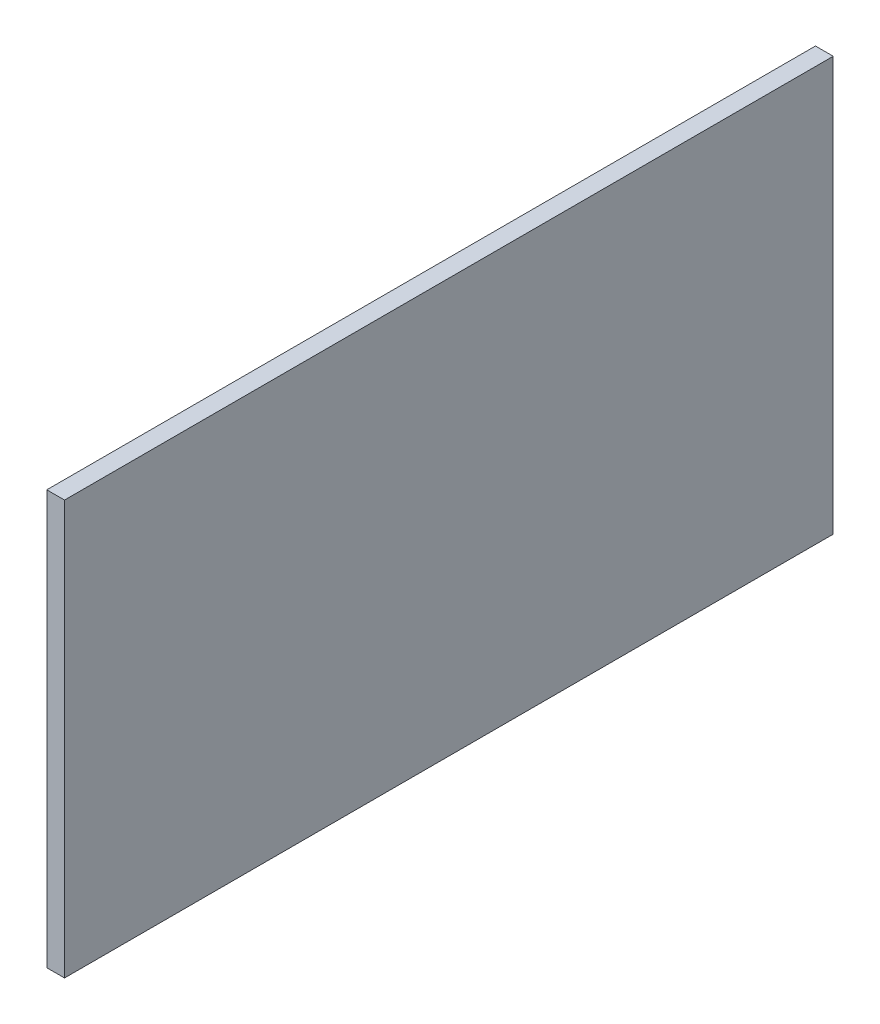
ISO-10303-21;
HEADER;
FILE_DESCRIPTION(('STEP AP214'),'2;1');
FILE_NAME('part.step','',(''),(''),'','','');
FILE_SCHEMA(('AUTOMOTIVE_DESIGN { 1 0 10303 214 1 1 1 1 }'));
ENDSEC;
DATA;
#1=APPLICATION_CONTEXT('core data for automotive mechanical design processes');
#2=APPLICATION_PROTOCOL_DEFINITION('international standard','automotive_design',2000,#1);
#3=PRODUCT_CONTEXT('',#1,'mechanical');
#4=PRODUCT('Part','Part','',(#3));
#5=PRODUCT_RELATED_PRODUCT_CATEGORY('part','',(#4));
#6=PRODUCT_DEFINITION_FORMATION('','',#4);
#7=PRODUCT_DEFINITION_CONTEXT('part definition',#1,'design');
#8=PRODUCT_DEFINITION('design','',#6,#7);
#9=PRODUCT_DEFINITION_SHAPE('','',#8);
#10=(LENGTH_UNIT() NAMED_UNIT(*) SI_UNIT(.MILLI.,.METRE.));
#11=(NAMED_UNIT(*) PLANE_ANGLE_UNIT() SI_UNIT($,.RADIAN.));
#12=(NAMED_UNIT(*) SI_UNIT($,.STERADIAN.) SOLID_ANGLE_UNIT());
#13=UNCERTAINTY_MEASURE_WITH_UNIT(LENGTH_MEASURE(1.E-05),#10,'distance_accuracy_value','');
#14=(GEOMETRIC_REPRESENTATION_CONTEXT(3) GLOBAL_UNCERTAINTY_ASSIGNED_CONTEXT((#13)) GLOBAL_UNIT_ASSIGNED_CONTEXT((#10,
#11,#12)) REPRESENTATION_CONTEXT('',''));
#15=CARTESIAN_POINT('',(0.,0.,0.));
#16=DIRECTION('',(0.,0.,1.));
#17=DIRECTION('',(1.,0.,0.));
#18=AXIS2_PLACEMENT_3D('',#15,#16,#17);
#19=CARTESIAN_POINT('',(3.,0.,71.2403461538176));
#20=DIRECTION('',(0.,0.,-1.));
#21=DIRECTION('',(-1.,0.,0.));
#22=AXIS2_PLACEMENT_3D('',#19,#20,#21);
#23=PLANE('',#22);
#24=DIRECTION('',(0.,-1.,0.));
#25=VECTOR('',#24,1.);
#26=CARTESIAN_POINT('',(0.,0.,71.2403461538176));
#27=LINE('',#26,#25);
#28=CARTESIAN_POINT('',(0.,70.,71.2403461538176));
#29=VERTEX_POINT('',#28);
#30=CARTESIAN_POINT('',(0.,0.,71.2403461538176));
#31=VERTEX_POINT('',#30);
#32=EDGE_CURVE('E96',#29,#31,#27,.T.);
#33=ORIENTED_EDGE('',*,*,#32,.T.);
#34=DIRECTION('',(-1.,0.,0.));
#35=VECTOR('',#34,1.);
#36=CARTESIAN_POINT('',(3.,0.,71.2403461538176));
#37=LINE('',#36,#35);
#38=CARTESIAN_POINT('',(3.,0.,71.2403461538176));
#39=VERTEX_POINT('',#38);
#40=EDGE_CURVE('E11',#39,#31,#37,.T.);
#41=ORIENTED_EDGE('',*,*,#40,.F.);
#42=DIRECTION('',(0.,-1.,0.));
#43=VECTOR('',#42,1.);
#44=CARTESIAN_POINT('',(3.,0.,71.2403461538176));
#45=LINE('',#44,#43);
#46=CARTESIAN_POINT('',(3.,70.,71.2403461538176));
#47=VERTEX_POINT('',#46);
#48=EDGE_CURVE('E84',#47,#39,#45,.T.);
#49=ORIENTED_EDGE('',*,*,#48,.F.);
#50=DIRECTION('',(-1.,0.,0.));
#51=VECTOR('',#50,1.);
#52=CARTESIAN_POINT('',(3.,70.,71.2403461538176));
#53=LINE('',#52,#51);
#54=EDGE_CURVE('E92',#47,#29,#53,.T.);
#55=ORIENTED_EDGE('',*,*,#54,.T.);
#56=EDGE_LOOP('',(#33,#41,#49,#55));
#57=FACE_BOUND('',#56,.T.);
#58=ADVANCED_FACE('F33',(#57),#23,.F.);
#59=CARTESIAN_POINT('',(3.,0.,71.2403461538176));
#60=DIRECTION('',(0.,1.,0.));
#61=DIRECTION('',(0.,0.,1.));
#62=AXIS2_PLACEMENT_3D('',#59,#60,#61);
#63=PLANE('',#62);
#64=DIRECTION('',(0.,0.,-1.));
#65=VECTOR('',#64,1.);
#66=CARTESIAN_POINT('',(0.,0.,71.2403461538176));
#67=LINE('',#66,#65);
#68=CARTESIAN_POINT('',(0.,0.,-58.7596538461824));
#69=VERTEX_POINT('',#68);
#70=EDGE_CURVE('E88',#31,#69,#67,.T.);
#71=ORIENTED_EDGE('',*,*,#70,.T.);
#72=DIRECTION('',(-1.,0.,0.));
#73=VECTOR('',#72,1.);
#74=CARTESIAN_POINT('',(3.,0.,-58.7596538461824));
#75=LINE('',#74,#73);
#76=CARTESIAN_POINT('',(3.,0.,-58.7596538461824));
#77=VERTEX_POINT('',#76);
#78=EDGE_CURVE('E41',#77,#69,#75,.T.);
#79=ORIENTED_EDGE('',*,*,#78,.F.);
#80=DIRECTION('',(0.,0.,-1.));
#81=VECTOR('',#80,1.);
#82=CARTESIAN_POINT('',(3.,0.,71.2403461538176));
#83=LINE('',#82,#81);
#84=EDGE_CURVE('E79',#39,#77,#83,.T.);
#85=ORIENTED_EDGE('',*,*,#84,.F.);
#86=ORIENTED_EDGE('',*,*,#40,.T.);
#87=EDGE_LOOP('',(#71,#79,#85,#86));
#88=FACE_BOUND('',#87,.T.);
#89=ADVANCED_FACE('F87',(#88),#63,.F.);
#90=CARTESIAN_POINT('',(3.,0.,-58.7596538461824));
#91=DIRECTION('',(0.,0.,1.));
#92=DIRECTION('',(1.,0.,0.));
#93=AXIS2_PLACEMENT_3D('',#90,#91,#92);
#94=PLANE('',#93);
#95=DIRECTION('',(0.,1.,0.));
#96=VECTOR('',#95,1.);
#97=CARTESIAN_POINT('',(0.,0.,-58.7596538461824));
#98=LINE('',#97,#96);
#99=CARTESIAN_POINT('',(0.,70.,-58.7596538461824));
#100=VERTEX_POINT('',#99);
#101=EDGE_CURVE('E66',#69,#100,#98,.T.);
#102=ORIENTED_EDGE('',*,*,#101,.T.);
#103=DIRECTION('',(-1.,0.,0.));
#104=VECTOR('',#103,1.);
#105=CARTESIAN_POINT('',(3.,70.,-58.7596538461824));
#106=LINE('',#105,#104);
#107=CARTESIAN_POINT('',(3.,70.,-58.7596538461824));
#108=VERTEX_POINT('',#107);
#109=EDGE_CURVE('E89',#108,#100,#106,.T.);
#110=ORIENTED_EDGE('',*,*,#109,.F.);
#111=DIRECTION('',(0.,1.,0.));
#112=VECTOR('',#111,1.);
#113=CARTESIAN_POINT('',(3.,0.,-58.7596538461824));
#114=LINE('',#113,#112);
#115=EDGE_CURVE('E82',#77,#108,#114,.T.);
#116=ORIENTED_EDGE('',*,*,#115,.F.);
#117=ORIENTED_EDGE('',*,*,#78,.T.);
#118=EDGE_LOOP('',(#102,#110,#116,#117));
#119=FACE_BOUND('',#118,.T.);
#120=ADVANCED_FACE('F90',(#119),#94,.F.);
#121=CARTESIAN_POINT('',(3.,70.,71.2403461538176));
#122=DIRECTION('',(0.,-1.,0.));
#123=DIRECTION('',(0.,0.,-1.));
#124=AXIS2_PLACEMENT_3D('',#121,#122,#123);
#125=PLANE('',#124);
#126=DIRECTION('',(0.,0.,1.));
#127=VECTOR('',#126,1.);
#128=CARTESIAN_POINT('',(0.,70.,71.2403461538176));
#129=LINE('',#128,#127);
#130=EDGE_CURVE('E72',#100,#29,#129,.T.);
#131=ORIENTED_EDGE('',*,*,#130,.T.);
#132=ORIENTED_EDGE('',*,*,#54,.F.);
#133=DIRECTION('',(0.,0.,1.));
#134=VECTOR('',#133,1.);
#135=CARTESIAN_POINT('',(3.,70.,71.2403461538176));
#136=LINE('',#135,#134);
#137=EDGE_CURVE('E49',#108,#47,#136,.T.);
#138=ORIENTED_EDGE('',*,*,#137,.F.);
#139=ORIENTED_EDGE('',*,*,#109,.T.);
#140=EDGE_LOOP('',(#131,#132,#138,#139));
#141=FACE_BOUND('',#140,.T.);
#142=ADVANCED_FACE('F103',(#141),#125,.F.);
#143=CARTESIAN_POINT('',(3.,0.,0.));
#144=DIRECTION('',(-1.,0.,0.));
#145=DIRECTION('',(0.,0.,1.));
#146=AXIS2_PLACEMENT_3D('',#143,#144,#145);
#147=PLANE('',#146);
#148=ORIENTED_EDGE('',*,*,#48,.T.);
#149=ORIENTED_EDGE('',*,*,#84,.T.);
#150=ORIENTED_EDGE('',*,*,#115,.T.);
#151=ORIENTED_EDGE('',*,*,#137,.T.);
#152=EDGE_LOOP('',(#148,#149,#150,#151));
#153=FACE_BOUND('',#152,.T.);
#154=ADVANCED_FACE('F80',(#153),#147,.F.);
#155=CARTESIAN_POINT('',(0.,0.,0.));
#156=DIRECTION('',(-1.,0.,0.));
#157=DIRECTION('',(0.,0.,1.));
#158=AXIS2_PLACEMENT_3D('',#155,#156,#157);
#159=PLANE('',#158);
#160=ORIENTED_EDGE('',*,*,#32,.F.);
#161=ORIENTED_EDGE('',*,*,#130,.F.);
#162=ORIENTED_EDGE('',*,*,#101,.F.);
#163=ORIENTED_EDGE('',*,*,#70,.F.);
#164=EDGE_LOOP('',(#160,#161,#162,#163));
#165=FACE_BOUND('',#164,.T.);
#166=ADVANCED_FACE('F106',(#165),#159,.T.);
#167=CLOSED_SHELL('',(#58,#89,#120,#142,#154,#166));
#168=MANIFOLD_SOLID_BREP('B2',#167);
#169=ADVANCED_BREP_SHAPE_REPRESENTATION('',(#18,#168),#14);
#170=SHAPE_DEFINITION_REPRESENTATION(#9,#169);
ENDSEC;
END-ISO-10303-21;
